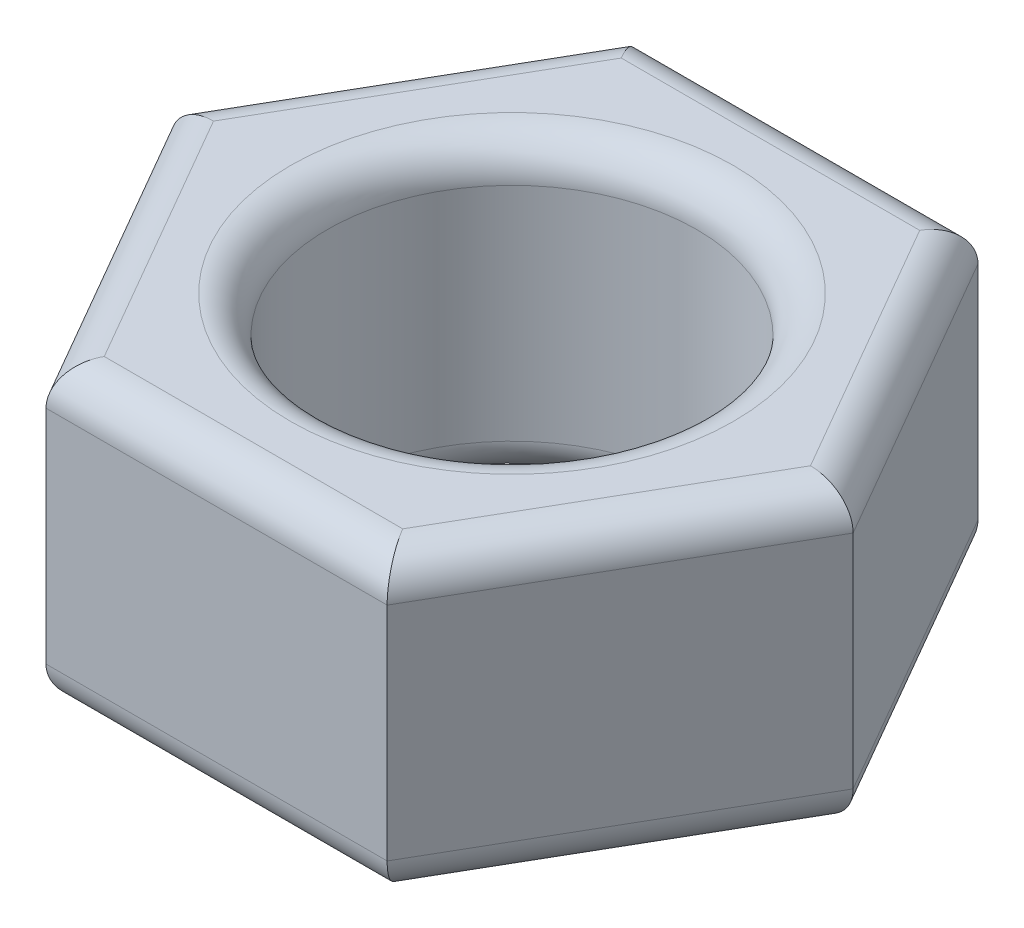
ISO-10303-21;
HEADER;
FILE_DESCRIPTION(('STEP AP214'),'2;1');
FILE_NAME('part.step','',(''),(''),'','','');
FILE_SCHEMA(('AUTOMOTIVE_DESIGN { 1 0 10303 214 1 1 1 1 }'));
ENDSEC;
DATA;
#1=APPLICATION_CONTEXT('core data for automotive mechanical design processes');
#2=APPLICATION_PROTOCOL_DEFINITION('international standard','automotive_design',2000,#1);
#3=PRODUCT_CONTEXT('',#1,'mechanical');
#4=PRODUCT('Part','Part','',(#3));
#5=PRODUCT_RELATED_PRODUCT_CATEGORY('part','',(#4));
#6=PRODUCT_DEFINITION_FORMATION('','',#4);
#7=PRODUCT_DEFINITION_CONTEXT('part definition',#1,'design');
#8=PRODUCT_DEFINITION('design','',#6,#7);
#9=PRODUCT_DEFINITION_SHAPE('','',#8);
#10=(LENGTH_UNIT() NAMED_UNIT(*) SI_UNIT(.MILLI.,.METRE.));
#11=(NAMED_UNIT(*) PLANE_ANGLE_UNIT() SI_UNIT($,.RADIAN.));
#12=(NAMED_UNIT(*) SI_UNIT($,.STERADIAN.) SOLID_ANGLE_UNIT());
#13=UNCERTAINTY_MEASURE_WITH_UNIT(LENGTH_MEASURE(1.E-05),#10,'distance_accuracy_value','');
#14=(GEOMETRIC_REPRESENTATION_CONTEXT(3) GLOBAL_UNCERTAINTY_ASSIGNED_CONTEXT((#13)) GLOBAL_UNIT_ASSIGNED_CONTEXT((#10,
#11,#12)) REPRESENTATION_CONTEXT('',''));
#15=CARTESIAN_POINT('',(0.,0.,0.));
#16=DIRECTION('',(0.,0.,1.));
#17=DIRECTION('',(1.,0.,0.));
#18=AXIS2_PLACEMENT_3D('',#15,#16,#17);
#19=CARTESIAN_POINT('',(0.,4.,0.));
#20=DIRECTION('',(0.,1.,0.));
#21=DIRECTION('',(0.,0.,1.));
#22=AXIS2_PLACEMENT_3D('',#19,#20,#21);
#23=PLANE('',#22);
#24=CARTESIAN_POINT('',(0.,4.,0.));
#25=DIRECTION('',(0.,1.,0.));
#26=DIRECTION('',(0.,0.,1.));
#27=AXIS2_PLACEMENT_3D('',#24,#25,#26);
#28=CIRCLE('',#27,3.);
#29=CARTESIAN_POINT('',(0.,4.,3.));
#30=VERTEX_POINT('',#29);
#31=EDGE_CURVE('E11',#30,#30,#28,.F.);
#32=ORIENTED_EDGE('',*,*,#31,.T.);
#33=EDGE_LOOP('',(#32));
#34=FACE_BOUND('',#33,.T.);
#35=DIRECTION('',(0.500000000000007,0.,0.866025403784435));
#36=VECTOR('',#35,1.);
#37=CARTESIAN_POINT('',(-1.87638837486625,4.,3.75000000000002));
#38=LINE('',#37,#36);
#39=CARTESIAN_POINT('',(-4.04145188432738,4.,0.));
#40=VERTEX_POINT('',#39);
#41=CARTESIAN_POINT('',(-2.02072594216366,4.,3.50000000000002));
#42=VERTEX_POINT('',#41);
#43=EDGE_CURVE('E148',#40,#42,#38,.T.);
#44=ORIENTED_EDGE('',*,*,#43,.T.);
#45=DIRECTION('',(1.,0.,0.));
#46=VECTOR('',#45,1.);
#47=CARTESIAN_POINT('',(2.30940107675854,4.,3.49999999999997));
#48=LINE('',#47,#46);
#49=CARTESIAN_POINT('',(2.02072594216373,4.,3.49999999999998));
#50=VERTEX_POINT('',#49);
#51=EDGE_CURVE('E129',#42,#50,#48,.T.);
#52=ORIENTED_EDGE('',*,*,#51,.T.);
#53=DIRECTION('',(0.499999999999992,0.,-0.866025403784444));
#54=VECTOR('',#53,1.);
#55=CARTESIAN_POINT('',(4.18578945162478,4.,-0.25000000000003));
#56=LINE('',#55,#54);
#57=CARTESIAN_POINT('',(4.04145188432738,4.,0.));
#58=VERTEX_POINT('',#57);
#59=EDGE_CURVE('E138',#50,#58,#56,.T.);
#60=ORIENTED_EDGE('',*,*,#59,.T.);
#61=DIRECTION('',(-0.500000000000006,0.,-0.866025403784435));
#62=VECTOR('',#61,1.);
#63=CARTESIAN_POINT('',(1.87638837486626,4.,-3.75000000000001));
#64=LINE('',#63,#62);
#65=CARTESIAN_POINT('',(2.02072594216366,4.,-3.50000000000001));
#66=VERTEX_POINT('',#65);
#67=EDGE_CURVE('E144',#58,#66,#64,.T.);
#68=ORIENTED_EDGE('',*,*,#67,.T.);
#69=DIRECTION('',(-1.,0.,0.));
#70=VECTOR('',#69,1.);
#71=CARTESIAN_POINT('',(-2.30940107675852,4.,-3.49999999999999));
#72=LINE('',#71,#70);
#73=CARTESIAN_POINT('',(-2.02072594216371,4.,-3.49999999999999));
#74=VERTEX_POINT('',#73);
#75=EDGE_CURVE('E341',#66,#74,#72,.T.);
#76=ORIENTED_EDGE('',*,*,#75,.T.);
#77=DIRECTION('',(-0.499999999999995,0.,0.866025403784442));
#78=VECTOR('',#77,1.);
#79=CARTESIAN_POINT('',(-4.18578945162478,4.,0.250000000000031));
#80=LINE('',#79,#78);
#81=EDGE_CURVE('E153',#74,#40,#80,.T.);
#82=ORIENTED_EDGE('',*,*,#81,.T.);
#83=EDGE_LOOP('',(#44,#52,#60,#68,#76,#82));
#84=FACE_BOUND('',#83,.T.);
#85=ADVANCED_FACE('F32',(#34,#84),#23,.T.);
#86=CARTESIAN_POINT('',(0.,0.,0.));
#87=DIRECTION('',(0.,1.,0.));
#88=DIRECTION('',(0.,0.,1.));
#89=AXIS2_PLACEMENT_3D('',#86,#87,#88);
#90=PLANE('',#89);
#91=CARTESIAN_POINT('',(0.,0.,0.));
#92=DIRECTION('',(0.,1.,0.));
#93=DIRECTION('',(0.,0.,1.));
#94=AXIS2_PLACEMENT_3D('',#91,#92,#93);
#95=CIRCLE('',#94,3.);
#96=CARTESIAN_POINT('',(0.,0.,3.));
#97=VERTEX_POINT('',#96);
#98=EDGE_CURVE('E191',#97,#97,#95,.T.);
#99=ORIENTED_EDGE('',*,*,#98,.T.);
#100=EDGE_LOOP('',(#99));
#101=FACE_BOUND('',#100,.T.);
#102=DIRECTION('',(-1.,0.,0.));
#103=VECTOR('',#102,1.);
#104=CARTESIAN_POINT('',(0.,0.,-3.5));
#105=LINE('',#104,#103);
#106=CARTESIAN_POINT('',(-2.02072594216371,0.,-3.49999999999999));
#107=VERTEX_POINT('',#106);
#108=CARTESIAN_POINT('',(2.02072594216366,0.,-3.50000000000001));
#109=VERTEX_POINT('',#108);
#110=EDGE_CURVE('E186',#107,#109,#105,.F.);
#111=ORIENTED_EDGE('',*,*,#110,.T.);
#112=DIRECTION('',(-0.500000000000006,0.,-0.866025403784435));
#113=VECTOR('',#112,1.);
#114=CARTESIAN_POINT('',(3.03108891324552,0.,-1.75000000000002));
#115=LINE('',#114,#113);
#116=CARTESIAN_POINT('',(4.04145188432738,0.,0.));
#117=VERTEX_POINT('',#116);
#118=EDGE_CURVE('E188',#109,#117,#115,.F.);
#119=ORIENTED_EDGE('',*,*,#118,.T.);
#120=DIRECTION('',(0.499999999999992,0.,-0.866025403784444));
#121=VECTOR('',#120,1.);
#122=CARTESIAN_POINT('',(3.03108891324556,0.,1.74999999999997));
#123=LINE('',#122,#121);
#124=CARTESIAN_POINT('',(2.02072594216373,0.,3.49999999999998));
#125=VERTEX_POINT('',#124);
#126=EDGE_CURVE('E165',#117,#125,#123,.F.);
#127=ORIENTED_EDGE('',*,*,#126,.T.);
#128=DIRECTION('',(1.,0.,0.));
#129=VECTOR('',#128,1.);
#130=CARTESIAN_POINT('',(0.,0.,3.5));
#131=LINE('',#130,#129);
#132=CARTESIAN_POINT('',(-2.02072594216366,0.,3.50000000000002));
#133=VERTEX_POINT('',#132);
#134=EDGE_CURVE('E180',#125,#133,#131,.F.);
#135=ORIENTED_EDGE('',*,*,#134,.T.);
#136=DIRECTION('',(0.500000000000007,0.,0.866025403784435));
#137=VECTOR('',#136,1.);
#138=CARTESIAN_POINT('',(-3.03108891324552,0.,1.75000000000002));
#139=LINE('',#138,#137);
#140=CARTESIAN_POINT('',(-4.04145188432738,0.,0.));
#141=VERTEX_POINT('',#140);
#142=EDGE_CURVE('E182',#133,#141,#139,.F.);
#143=ORIENTED_EDGE('',*,*,#142,.T.);
#144=DIRECTION('',(-0.499999999999995,0.,0.866025403784442));
#145=VECTOR('',#144,1.);
#146=CARTESIAN_POINT('',(-3.03108891324554,0.,-1.74999999999998));
#147=LINE('',#146,#145);
#148=EDGE_CURVE('E184',#141,#107,#147,.F.);
#149=ORIENTED_EDGE('',*,*,#148,.T.);
#150=EDGE_LOOP('',(#111,#119,#127,#135,#143,#149));
#151=FACE_BOUND('',#150,.T.);
#152=ADVANCED_FACE('F239',(#101,#151),#90,.F.);
#153=CARTESIAN_POINT('',(2.30940107675855,4.,3.99999999999997));
#154=DIRECTION('',(-0.866025403784443,0.,-0.499999999999992));
#155=DIRECTION('',(-0.499999999999992,0.,0.866025403784444));
#156=AXIS2_PLACEMENT_3D('',#153,#154,#155);
#157=PLANE('',#156);
#158=DIRECTION('',(0.,-1.,0.));
#159=VECTOR('',#158,1.);
#160=CARTESIAN_POINT('',(2.30940107675855,4.,3.99999999999997));
#161=LINE('',#160,#159);
#162=CARTESIAN_POINT('',(2.30940107675855,3.5,3.99999999999997));
#163=VERTEX_POINT('',#162);
#164=CARTESIAN_POINT('',(2.30940107675855,0.5,3.99999999999997));
#165=VERTEX_POINT('',#164);
#166=EDGE_CURVE('E178',#163,#165,#161,.T.);
#167=ORIENTED_EDGE('',*,*,#166,.T.);
#168=DIRECTION('',(0.499999999999992,0.,-0.866025403784444));
#169=VECTOR('',#168,1.);
#170=CARTESIAN_POINT('',(2.30940107675855,0.5,3.99999999999997));
#171=LINE('',#170,#169);
#172=CARTESIAN_POINT('',(4.618802153517,0.5,0.));
#173=VERTEX_POINT('',#172);
#174=EDGE_CURVE('E206',#165,#173,#171,.T.);
#175=ORIENTED_EDGE('',*,*,#174,.T.);
#176=DIRECTION('',(0.,-1.,0.));
#177=VECTOR('',#176,1.);
#178=CARTESIAN_POINT('',(4.618802153517,4.,0.));
#179=LINE('',#178,#177);
#180=CARTESIAN_POINT('',(4.618802153517,3.5,0.));
#181=VERTEX_POINT('',#180);
#182=EDGE_CURVE('E145',#181,#173,#179,.T.);
#183=ORIENTED_EDGE('',*,*,#182,.F.);
#184=DIRECTION('',(0.499999999999992,0.,-0.866025403784444));
#185=VECTOR('',#184,1.);
#186=CARTESIAN_POINT('',(2.30940107675855,3.5,3.99999999999997));
#187=LINE('',#186,#185);
#188=EDGE_CURVE('E164',#181,#163,#187,.F.);
#189=ORIENTED_EDGE('',*,*,#188,.T.);
#190=EDGE_LOOP('',(#167,#175,#183,#189));
#191=FACE_BOUND('',#190,.T.);
#192=ADVANCED_FACE('F245',(#191),#157,.F.);
#193=CARTESIAN_POINT('',(4.618802153517,4.,0.));
#194=DIRECTION('',(-0.866025403784435,0.,0.500000000000006));
#195=DIRECTION('',(0.500000000000006,0.,0.866025403784435));
#196=AXIS2_PLACEMENT_3D('',#193,#194,#195);
#197=PLANE('',#196);
#198=ORIENTED_EDGE('',*,*,#182,.T.);
#199=DIRECTION('',(-0.500000000000006,0.,-0.866025403784435));
#200=VECTOR('',#199,1.);
#201=CARTESIAN_POINT('',(4.618802153517,0.5,0.));
#202=LINE('',#201,#200);
#203=CARTESIAN_POINT('',(2.30940107675847,0.5,-4.00000000000002));
#204=VERTEX_POINT('',#203);
#205=EDGE_CURVE('E197',#173,#204,#202,.T.);
#206=ORIENTED_EDGE('',*,*,#205,.T.);
#207=DIRECTION('',(0.,-1.,0.));
#208=VECTOR('',#207,1.);
#209=CARTESIAN_POINT('',(2.30940107675847,4.,-4.00000000000002));
#210=LINE('',#209,#208);
#211=CARTESIAN_POINT('',(2.30940107675847,3.5,-4.00000000000002));
#212=VERTEX_POINT('',#211);
#213=EDGE_CURVE('E334',#212,#204,#210,.T.);
#214=ORIENTED_EDGE('',*,*,#213,.F.);
#215=DIRECTION('',(-0.500000000000006,0.,-0.866025403784435));
#216=VECTOR('',#215,1.);
#217=CARTESIAN_POINT('',(4.618802153517,3.5,0.));
#218=LINE('',#217,#216);
#219=EDGE_CURVE('E162',#212,#181,#218,.F.);
#220=ORIENTED_EDGE('',*,*,#219,.T.);
#221=EDGE_LOOP('',(#198,#206,#214,#220));
#222=FACE_BOUND('',#221,.T.);
#223=ADVANCED_FACE('F263',(#222),#197,.F.);
#224=CARTESIAN_POINT('',(2.30940107675847,4.,-4.00000000000002));
#225=DIRECTION('',(0.,0.,1.));
#226=DIRECTION('',(1.,0.,0.));
#227=AXIS2_PLACEMENT_3D('',#224,#225,#226);
#228=PLANE('',#227);
#229=ORIENTED_EDGE('',*,*,#213,.T.);
#230=DIRECTION('',(-1.,0.,0.));
#231=VECTOR('',#230,1.);
#232=CARTESIAN_POINT('',(2.30940107675847,0.5,-4.00000000000002));
#233=LINE('',#232,#231);
#234=CARTESIAN_POINT('',(-2.30940107675852,0.5,-3.99999999999999));
#235=VERTEX_POINT('',#234);
#236=EDGE_CURVE('E200',#204,#235,#233,.T.);
#237=ORIENTED_EDGE('',*,*,#236,.T.);
#238=DIRECTION('',(0.,-1.,0.));
#239=VECTOR('',#238,1.);
#240=CARTESIAN_POINT('',(-2.30940107675852,4.,-3.99999999999999));
#241=LINE('',#240,#239);
#242=CARTESIAN_POINT('',(-2.30940107675852,3.5,-3.99999999999999));
#243=VERTEX_POINT('',#242);
#244=EDGE_CURVE('E336',#243,#235,#241,.T.);
#245=ORIENTED_EDGE('',*,*,#244,.F.);
#246=DIRECTION('',(-1.,0.,0.));
#247=VECTOR('',#246,1.);
#248=CARTESIAN_POINT('',(2.30940107675847,3.5,-4.00000000000002));
#249=LINE('',#248,#247);
#250=EDGE_CURVE('E160',#243,#212,#249,.F.);
#251=ORIENTED_EDGE('',*,*,#250,.T.);
#252=EDGE_LOOP('',(#229,#237,#245,#251));
#253=FACE_BOUND('',#252,.T.);
#254=ADVANCED_FACE('F259',(#253),#228,.F.);
#255=CARTESIAN_POINT('',(-2.30940107675852,4.,-3.99999999999999));
#256=DIRECTION('',(0.866025403784442,0.,0.499999999999995));
#257=DIRECTION('',(0.499999999999995,0.,-0.866025403784442));
#258=AXIS2_PLACEMENT_3D('',#255,#256,#257);
#259=PLANE('',#258);
#260=ORIENTED_EDGE('',*,*,#244,.T.);
#261=DIRECTION('',(-0.499999999999995,0.,0.866025403784442));
#262=VECTOR('',#261,1.);
#263=CARTESIAN_POINT('',(-2.30940107675852,0.5,-3.99999999999999));
#264=LINE('',#263,#262);
#265=CARTESIAN_POINT('',(-4.618802153517,0.5,0.));
#266=VERTEX_POINT('',#265);
#267=EDGE_CURVE('E202',#235,#266,#264,.T.);
#268=ORIENTED_EDGE('',*,*,#267,.T.);
#269=DIRECTION('',(0.,-1.,0.));
#270=VECTOR('',#269,1.);
#271=CARTESIAN_POINT('',(-4.618802153517,4.,0.));
#272=LINE('',#271,#270);
#273=CARTESIAN_POINT('',(-4.618802153517,3.5,0.));
#274=VERTEX_POINT('',#273);
#275=EDGE_CURVE('E350',#274,#266,#272,.T.);
#276=ORIENTED_EDGE('',*,*,#275,.F.);
#277=DIRECTION('',(-0.499999999999995,0.,0.866025403784442));
#278=VECTOR('',#277,1.);
#279=CARTESIAN_POINT('',(-2.30940107675852,3.5,-3.99999999999999));
#280=LINE('',#279,#278);
#281=EDGE_CURVE('E158',#274,#243,#280,.F.);
#282=ORIENTED_EDGE('',*,*,#281,.T.);
#283=EDGE_LOOP('',(#260,#268,#276,#282));
#284=FACE_BOUND('',#283,.T.);
#285=ADVANCED_FACE('F256',(#284),#259,.F.);
#286=CARTESIAN_POINT('',(-4.618802153517,4.,0.));
#287=DIRECTION('',(0.866025403784435,0.,-0.500000000000007));
#288=DIRECTION('',(-0.500000000000007,0.,-0.866025403784435));
#289=AXIS2_PLACEMENT_3D('',#286,#287,#288);
#290=PLANE('',#289);
#291=ORIENTED_EDGE('',*,*,#275,.T.);
#292=DIRECTION('',(0.500000000000007,0.,0.866025403784435));
#293=VECTOR('',#292,1.);
#294=CARTESIAN_POINT('',(-4.618802153517,0.5,0.));
#295=LINE('',#294,#293);
#296=CARTESIAN_POINT('',(-2.30940107675847,0.5,4.00000000000002));
#297=VERTEX_POINT('',#296);
#298=EDGE_CURVE('E55',#266,#297,#295,.T.);
#299=ORIENTED_EDGE('',*,*,#298,.T.);
#300=DIRECTION('',(0.,-1.,0.));
#301=VECTOR('',#300,1.);
#302=CARTESIAN_POINT('',(-2.30940107675847,4.,4.00000000000002));
#303=LINE('',#302,#301);
#304=CARTESIAN_POINT('',(-2.30940107675847,3.5,4.00000000000002));
#305=VERTEX_POINT('',#304);
#306=EDGE_CURVE('E349',#305,#297,#303,.T.);
#307=ORIENTED_EDGE('',*,*,#306,.F.);
#308=DIRECTION('',(0.500000000000007,0.,0.866025403784435));
#309=VECTOR('',#308,1.);
#310=CARTESIAN_POINT('',(-4.618802153517,3.5,0.));
#311=LINE('',#310,#309);
#312=EDGE_CURVE('E151',#305,#274,#311,.F.);
#313=ORIENTED_EDGE('',*,*,#312,.T.);
#314=EDGE_LOOP('',(#291,#299,#307,#313));
#315=FACE_BOUND('',#314,.T.);
#316=ADVANCED_FACE('F253',(#315),#290,.F.);
#317=CARTESIAN_POINT('',(-2.30940107675847,4.,4.00000000000002));
#318=DIRECTION('',(0.,0.,-1.));
#319=DIRECTION('',(-1.,0.,0.));
#320=AXIS2_PLACEMENT_3D('',#317,#318,#319);
#321=PLANE('',#320);
#322=ORIENTED_EDGE('',*,*,#306,.T.);
#323=DIRECTION('',(1.,0.,0.));
#324=VECTOR('',#323,1.);
#325=CARTESIAN_POINT('',(-2.30940107675847,0.5,4.00000000000002));
#326=LINE('',#325,#324);
#327=EDGE_CURVE('E47',#297,#165,#326,.T.);
#328=ORIENTED_EDGE('',*,*,#327,.T.);
#329=ORIENTED_EDGE('',*,*,#166,.F.);
#330=DIRECTION('',(1.,0.,0.));
#331=VECTOR('',#330,1.);
#332=CARTESIAN_POINT('',(-2.30940107675847,3.5,4.00000000000002));
#333=LINE('',#332,#331);
#334=EDGE_CURVE('E131',#163,#305,#333,.F.);
#335=ORIENTED_EDGE('',*,*,#334,.T.);
#336=EDGE_LOOP('',(#322,#328,#329,#335));
#337=FACE_BOUND('',#336,.T.);
#338=ADVANCED_FACE('F250',(#337),#321,.F.);
#339=CARTESIAN_POINT('',(0.,4.,0.));
#340=DIRECTION('',(0.,-1.,0.));
#341=DIRECTION('',(0.,0.,-1.));
#342=AXIS2_PLACEMENT_3D('',#339,#340,#341);
#343=CYLINDRICAL_SURFACE('',#342,2.5);
#344=CARTESIAN_POINT('',(0.,3.5,0.));
#345=DIRECTION('',(0.,1.,0.));
#346=DIRECTION('',(0.,0.,1.));
#347=AXIS2_PLACEMENT_3D('',#344,#345,#346);
#348=CIRCLE('',#347,2.5);
#349=CARTESIAN_POINT('',(0.,3.5,2.5));
#350=VERTEX_POINT('',#349);
#351=EDGE_CURVE('E40',#350,#350,#348,.T.);
#352=ORIENTED_EDGE('',*,*,#351,.T.);
#353=EDGE_LOOP('',(#352));
#354=FACE_BOUND('',#353,.T.);
#355=CARTESIAN_POINT('',(0.,0.5,0.));
#356=DIRECTION('',(0.,1.,0.));
#357=DIRECTION('',(0.,0.,1.));
#358=AXIS2_PLACEMENT_3D('',#355,#356,#357);
#359=CIRCLE('',#358,2.5);
#360=CARTESIAN_POINT('',(0.,0.5,2.5));
#361=VERTEX_POINT('',#360);
#362=EDGE_CURVE('E194',#361,#361,#359,.F.);
#363=ORIENTED_EDGE('',*,*,#362,.T.);
#364=EDGE_LOOP('',(#363));
#365=FACE_BOUND('',#364,.T.);
#366=ADVANCED_FACE('F225',(#354,#365),#343,.F.);
#367=CARTESIAN_POINT('',(0.,3.5,-3.5));
#368=DIRECTION('',(1.,0.,0.));
#369=DIRECTION('',(0.,0.,-1.));
#370=AXIS2_PLACEMENT_3D('',#367,#368,#369);
#371=CYLINDRICAL_SURFACE('',#370,0.5);
#372=CARTESIAN_POINT('',(2.02072594216366,3.5,-3.50000000000001));
#373=DIRECTION('',(0.866025403784442,0.,0.499999999999994));
#374=DIRECTION('',(-0.499999999999994,0.,0.866025403784442));
#375=AXIS2_PLACEMENT_3D('',#372,#373,#374);
#376=ELLIPSE('',#375,0.577350269189626,0.5);
#377=EDGE_CURVE('E172',#212,#66,#376,.T.);
#378=ORIENTED_EDGE('',*,*,#377,.F.);
#379=ORIENTED_EDGE('',*,*,#250,.F.);
#380=CARTESIAN_POINT('',(-2.0207259421637,3.5,-3.49999999999999));
#381=DIRECTION('',(0.866025403784435,0.,-0.500000000000005));
#382=DIRECTION('',(0.500000000000005,0.,0.866025403784436));
#383=AXIS2_PLACEMENT_3D('',#380,#381,#382);
#384=ELLIPSE('',#383,0.577350269189626,0.5);
#385=EDGE_CURVE('E175',#74,#243,#384,.F.);
#386=ORIENTED_EDGE('',*,*,#385,.F.);
#387=ORIENTED_EDGE('',*,*,#75,.F.);
#388=EDGE_LOOP('',(#378,#379,#386,#387));
#389=FACE_BOUND('',#388,.T.);
#390=ADVANCED_FACE('F287',(#389),#371,.T.);
#391=CARTESIAN_POINT('',(-3.03108891324554,3.5,-1.74999999999998));
#392=DIRECTION('',(0.499999999999995,0.,-0.866025403784442));
#393=DIRECTION('',(-0.866025403784442,0.,-0.499999999999995));
#394=AXIS2_PLACEMENT_3D('',#391,#392,#393);
#395=CYLINDRICAL_SURFACE('',#394,0.5);
#396=ORIENTED_EDGE('',*,*,#385,.T.);
#397=ORIENTED_EDGE('',*,*,#281,.F.);
#398=CARTESIAN_POINT('',(-4.04145188432738,3.5,0.));
#399=DIRECTION('',(0.,0.,-1.));
#400=DIRECTION('',(1.,0.,0.));
#401=AXIS2_PLACEMENT_3D('',#398,#399,#400);
#402=ELLIPSE('',#401,0.577350269189626,0.5);
#403=EDGE_CURVE('E169',#40,#274,#402,.F.);
#404=ORIENTED_EDGE('',*,*,#403,.F.);
#405=ORIENTED_EDGE('',*,*,#81,.F.);
#406=EDGE_LOOP('',(#396,#397,#404,#405));
#407=FACE_BOUND('',#406,.T.);
#408=ADVANCED_FACE('F283',(#407),#395,.T.);
#409=CARTESIAN_POINT('',(3.03108891324552,3.5,-1.75000000000002));
#410=DIRECTION('',(0.500000000000006,0.,0.866025403784435));
#411=DIRECTION('',(0.866025403784435,0.,-0.500000000000006));
#412=AXIS2_PLACEMENT_3D('',#409,#410,#411);
#413=CYLINDRICAL_SURFACE('',#412,0.5);
#414=ORIENTED_EDGE('',*,*,#377,.T.);
#415=ORIENTED_EDGE('',*,*,#67,.F.);
#416=CARTESIAN_POINT('',(4.04145188432738,3.5,0.));
#417=DIRECTION('',(0.,0.,1.));
#418=DIRECTION('',(-1.,0.,0.));
#419=AXIS2_PLACEMENT_3D('',#416,#417,#418);
#420=ELLIPSE('',#419,0.577350269189625,0.5);
#421=EDGE_CURVE('E141',#181,#58,#420,.T.);
#422=ORIENTED_EDGE('',*,*,#421,.F.);
#423=ORIENTED_EDGE('',*,*,#219,.F.);
#424=EDGE_LOOP('',(#414,#415,#422,#423));
#425=FACE_BOUND('',#424,.T.);
#426=ADVANCED_FACE('F279',(#425),#413,.T.);
#427=CARTESIAN_POINT('',(-3.03108891324552,3.5,1.75000000000002));
#428=DIRECTION('',(-0.500000000000007,0.,-0.866025403784435));
#429=DIRECTION('',(-0.866025403784435,0.,0.500000000000007));
#430=AXIS2_PLACEMENT_3D('',#427,#428,#429);
#431=CYLINDRICAL_SURFACE('',#430,0.5);
#432=ORIENTED_EDGE('',*,*,#403,.T.);
#433=ORIENTED_EDGE('',*,*,#312,.F.);
#434=CARTESIAN_POINT('',(-2.02072594216366,3.5,3.50000000000002));
#435=DIRECTION('',(-0.866025403784443,0.,-0.499999999999992));
#436=DIRECTION('',(0.499999999999992,0.,-0.866025403784443));
#437=AXIS2_PLACEMENT_3D('',#434,#435,#436);
#438=ELLIPSE('',#437,0.577350269189626,0.5);
#439=EDGE_CURVE('E134',#42,#305,#438,.F.);
#440=ORIENTED_EDGE('',*,*,#439,.F.);
#441=ORIENTED_EDGE('',*,*,#43,.F.);
#442=EDGE_LOOP('',(#432,#433,#440,#441));
#443=FACE_BOUND('',#442,.T.);
#444=ADVANCED_FACE('F276',(#443),#431,.T.);
#445=CARTESIAN_POINT('',(3.03108891324556,3.5,1.74999999999997));
#446=DIRECTION('',(-0.499999999999992,0.,0.866025403784444));
#447=DIRECTION('',(0.866025403784443,0.,0.499999999999992));
#448=AXIS2_PLACEMENT_3D('',#445,#446,#447);
#449=CYLINDRICAL_SURFACE('',#448,0.5);
#450=ORIENTED_EDGE('',*,*,#421,.T.);
#451=ORIENTED_EDGE('',*,*,#59,.F.);
#452=CARTESIAN_POINT('',(2.02072594216373,3.5,3.49999999999998));
#453=DIRECTION('',(-0.866025403784434,0.,0.500000000000009));
#454=DIRECTION('',(0.500000000000009,0.,0.866025403784434));
#455=AXIS2_PLACEMENT_3D('',#452,#453,#454);
#456=ELLIPSE('',#455,0.577350269189626,0.5);
#457=EDGE_CURVE('E125',#163,#50,#456,.T.);
#458=ORIENTED_EDGE('',*,*,#457,.F.);
#459=ORIENTED_EDGE('',*,*,#188,.F.);
#460=EDGE_LOOP('',(#450,#451,#458,#459));
#461=FACE_BOUND('',#460,.T.);
#462=ADVANCED_FACE('F139',(#461),#449,.T.);
#463=CARTESIAN_POINT('',(0.,3.5,3.5));
#464=DIRECTION('',(-1.,0.,0.));
#465=DIRECTION('',(0.,0.,1.));
#466=AXIS2_PLACEMENT_3D('',#463,#464,#465);
#467=CYLINDRICAL_SURFACE('',#466,0.5);
#468=ORIENTED_EDGE('',*,*,#439,.T.);
#469=ORIENTED_EDGE('',*,*,#334,.F.);
#470=ORIENTED_EDGE('',*,*,#457,.T.);
#471=ORIENTED_EDGE('',*,*,#51,.F.);
#472=EDGE_LOOP('',(#468,#469,#470,#471));
#473=FACE_BOUND('',#472,.T.);
#474=ADVANCED_FACE('F127',(#473),#467,.T.);
#475=CARTESIAN_POINT('',(0.,0.5,0.));
#476=DIRECTION('',(0.,1.,0.));
#477=DIRECTION('',(0.,0.,1.));
#478=AXIS2_PLACEMENT_3D('',#475,#476,#477);
#479=TOROIDAL_SURFACE('',#478,3.,0.5);
#480=ORIENTED_EDGE('',*,*,#362,.F.);
#481=EDGE_LOOP('',(#480));
#482=FACE_BOUND('',#481,.T.);
#483=ORIENTED_EDGE('',*,*,#98,.F.);
#484=EDGE_LOOP('',(#483));
#485=FACE_BOUND('',#484,.T.);
#486=ADVANCED_FACE('F273',(#482,#485),#479,.T.);
#487=CARTESIAN_POINT('',(-4.18578945162479,0.5,-0.249999999999971));
#488=DIRECTION('',(0.500000000000007,0.,0.866025403784435));
#489=DIRECTION('',(0.866025403784435,0.,-0.500000000000007));
#490=AXIS2_PLACEMENT_3D('',#487,#488,#489);
#491=CYLINDRICAL_SURFACE('',#490,0.5);
#492=CARTESIAN_POINT('',(-4.04145188432738,0.5,0.));
#493=DIRECTION('',(0.,0.,1.));
#494=DIRECTION('',(1.,0.,0.));
#495=AXIS2_PLACEMENT_3D('',#492,#493,#494);
#496=ELLIPSE('',#495,0.577350269189626,0.5);
#497=EDGE_CURVE('E218',#141,#266,#496,.F.);
#498=ORIENTED_EDGE('',*,*,#497,.F.);
#499=ORIENTED_EDGE('',*,*,#142,.F.);
#500=CARTESIAN_POINT('',(-2.02072594216366,0.5,3.50000000000002));
#501=DIRECTION('',(0.866025403784443,0.,0.499999999999992));
#502=DIRECTION('',(0.499999999999992,0.,-0.866025403784443));
#503=AXIS2_PLACEMENT_3D('',#500,#501,#502);
#504=ELLIPSE('',#503,0.577350269189626,0.5);
#505=EDGE_CURVE('E135',#297,#133,#504,.T.);
#506=ORIENTED_EDGE('',*,*,#505,.F.);
#507=ORIENTED_EDGE('',*,*,#298,.F.);
#508=EDGE_LOOP('',(#498,#499,#506,#507));
#509=FACE_BOUND('',#508,.T.);
#510=ADVANCED_FACE('F293',(#509),#491,.T.);
#511=CARTESIAN_POINT('',(-2.30940107675847,0.5,3.50000000000002));
#512=DIRECTION('',(1.,0.,0.));
#513=DIRECTION('',(0.,0.,-1.));
#514=AXIS2_PLACEMENT_3D('',#511,#512,#513);
#515=CYLINDRICAL_SURFACE('',#514,0.5);
#516=ORIENTED_EDGE('',*,*,#505,.T.);
#517=ORIENTED_EDGE('',*,*,#134,.F.);
#518=CARTESIAN_POINT('',(2.02072594216373,0.5,3.49999999999998));
#519=DIRECTION('',(0.866025403784434,0.,-0.500000000000009));
#520=DIRECTION('',(-0.500000000000009,0.,-0.866025403784434));
#521=AXIS2_PLACEMENT_3D('',#518,#519,#520);
#522=ELLIPSE('',#521,0.577350269189626,0.5);
#523=EDGE_CURVE('E215',#165,#125,#522,.T.);
#524=ORIENTED_EDGE('',*,*,#523,.F.);
#525=ORIENTED_EDGE('',*,*,#327,.F.);
#526=EDGE_LOOP('',(#516,#517,#524,#525));
#527=FACE_BOUND('',#526,.T.);
#528=ADVANCED_FACE('F306',(#527),#515,.T.);
#529=CARTESIAN_POINT('',(-1.8763883748663,0.5,-3.74999999999999));
#530=DIRECTION('',(-0.499999999999995,0.,0.866025403784442));
#531=DIRECTION('',(0.866025403784442,0.,0.499999999999995));
#532=AXIS2_PLACEMENT_3D('',#529,#530,#531);
#533=CYLINDRICAL_SURFACE('',#532,0.5);
#534=ORIENTED_EDGE('',*,*,#497,.T.);
#535=ORIENTED_EDGE('',*,*,#267,.F.);
#536=CARTESIAN_POINT('',(-2.02072594216371,0.5,-3.49999999999999));
#537=DIRECTION('',(-0.866025403784435,0.,0.500000000000005));
#538=DIRECTION('',(0.500000000000005,0.,0.866025403784436));
#539=AXIS2_PLACEMENT_3D('',#536,#537,#538);
#540=ELLIPSE('',#539,0.577350269189626,0.5);
#541=EDGE_CURVE('E212',#107,#235,#540,.F.);
#542=ORIENTED_EDGE('',*,*,#541,.F.);
#543=ORIENTED_EDGE('',*,*,#148,.F.);
#544=EDGE_LOOP('',(#534,#535,#542,#543));
#545=FACE_BOUND('',#544,.T.);
#546=ADVANCED_FACE('F302',(#545),#533,.T.);
#547=CARTESIAN_POINT('',(1.87638837486633,0.5,3.74999999999998));
#548=DIRECTION('',(0.499999999999992,0.,-0.866025403784444));
#549=DIRECTION('',(-0.866025403784443,0.,-0.499999999999992));
#550=AXIS2_PLACEMENT_3D('',#547,#548,#549);
#551=CYLINDRICAL_SURFACE('',#550,0.5);
#552=ORIENTED_EDGE('',*,*,#523,.T.);
#553=ORIENTED_EDGE('',*,*,#126,.F.);
#554=CARTESIAN_POINT('',(4.04145188432738,0.5,0.));
#555=DIRECTION('',(0.,0.,-1.));
#556=DIRECTION('',(1.,0.,0.));
#557=AXIS2_PLACEMENT_3D('',#554,#555,#556);
#558=ELLIPSE('',#557,0.577350269189625,0.5);
#559=EDGE_CURVE('E210',#173,#117,#558,.T.);
#560=ORIENTED_EDGE('',*,*,#559,.F.);
#561=ORIENTED_EDGE('',*,*,#174,.F.);
#562=EDGE_LOOP('',(#552,#553,#560,#561));
#563=FACE_BOUND('',#562,.T.);
#564=ADVANCED_FACE('F298',(#563),#551,.T.);
#565=CARTESIAN_POINT('',(2.30940107675848,0.5,-3.50000000000002));
#566=DIRECTION('',(-1.,0.,0.));
#567=DIRECTION('',(0.,0.,1.));
#568=AXIS2_PLACEMENT_3D('',#565,#566,#567);
#569=CYLINDRICAL_SURFACE('',#568,0.5);
#570=ORIENTED_EDGE('',*,*,#541,.T.);
#571=ORIENTED_EDGE('',*,*,#236,.F.);
#572=CARTESIAN_POINT('',(2.02072594216366,0.5,-3.50000000000001));
#573=DIRECTION('',(-0.866025403784442,0.,-0.499999999999994));
#574=DIRECTION('',(-0.499999999999994,0.,0.866025403784442));
#575=AXIS2_PLACEMENT_3D('',#572,#573,#574);
#576=ELLIPSE('',#575,0.577350269189626,0.5);
#577=EDGE_CURVE('E208',#109,#204,#576,.F.);
#578=ORIENTED_EDGE('',*,*,#577,.F.);
#579=ORIENTED_EDGE('',*,*,#110,.F.);
#580=EDGE_LOOP('',(#570,#571,#578,#579));
#581=FACE_BOUND('',#580,.T.);
#582=ADVANCED_FACE('F234',(#581),#569,.T.);
#583=CARTESIAN_POINT('',(4.18578945162479,0.5,0.24999999999997));
#584=DIRECTION('',(-0.500000000000006,0.,-0.866025403784435));
#585=DIRECTION('',(-0.866025403784435,0.,0.500000000000006));
#586=AXIS2_PLACEMENT_3D('',#583,#584,#585);
#587=CYLINDRICAL_SURFACE('',#586,0.5);
#588=ORIENTED_EDGE('',*,*,#559,.T.);
#589=ORIENTED_EDGE('',*,*,#118,.F.);
#590=ORIENTED_EDGE('',*,*,#577,.T.);
#591=ORIENTED_EDGE('',*,*,#205,.F.);
#592=EDGE_LOOP('',(#588,#589,#590,#591));
#593=FACE_BOUND('',#592,.T.);
#594=ADVANCED_FACE('F229',(#593),#587,.T.);
#595=CARTESIAN_POINT('',(0.,3.5,0.));
#596=DIRECTION('',(0.,1.,0.));
#597=DIRECTION('',(0.,0.,1.));
#598=AXIS2_PLACEMENT_3D('',#595,#596,#597);
#599=TOROIDAL_SURFACE('',#598,3.,0.5);
#600=ORIENTED_EDGE('',*,*,#31,.F.);
#601=EDGE_LOOP('',(#600));
#602=FACE_BOUND('',#601,.T.);
#603=ORIENTED_EDGE('',*,*,#351,.F.);
#604=EDGE_LOOP('',(#603));
#605=FACE_BOUND('',#604,.T.);
#606=ADVANCED_FACE('F34',(#602,#605),#599,.T.);
#607=CLOSED_SHELL('',(#85,#152,#192,#223,#254,#285,#316,#338,#366,#390,#408,#426,#444,#462,#474,
#486,#510,#528,#546,#564,#582,#594,#606));
#608=MANIFOLD_SOLID_BREP('B2',#607);
#609=ADVANCED_BREP_SHAPE_REPRESENTATION('',(#18,#608),#14);
#610=SHAPE_DEFINITION_REPRESENTATION(#9,#609);
ENDSEC;
END-ISO-10303-21;
